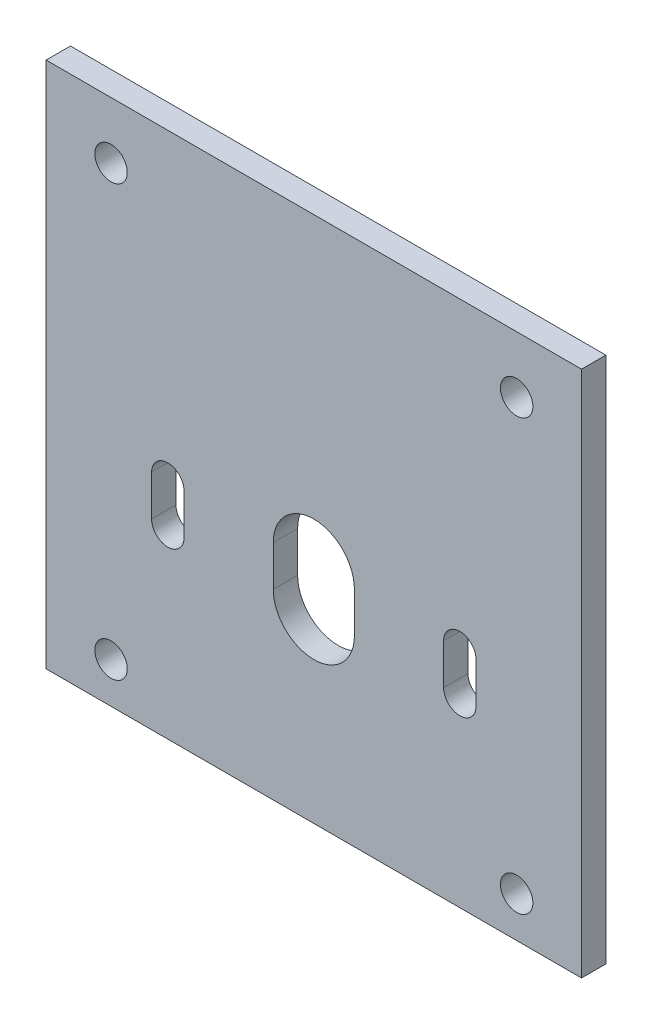
ISO-10303-21;
HEADER;
FILE_DESCRIPTION(('STEP AP214'),'2;1');
FILE_NAME('part.step','',(''),(''),'','','');
FILE_SCHEMA(('AUTOMOTIVE_DESIGN { 1 0 10303 214 1 1 1 1 }'));
ENDSEC;
DATA;
#1=APPLICATION_CONTEXT('core data for automotive mechanical design processes');
#2=APPLICATION_PROTOCOL_DEFINITION('international standard','automotive_design',2000,#1);
#3=PRODUCT_CONTEXT('',#1,'mechanical');
#4=PRODUCT('Part','Part','',(#3));
#5=PRODUCT_RELATED_PRODUCT_CATEGORY('part','',(#4));
#6=PRODUCT_DEFINITION_FORMATION('','',#4);
#7=PRODUCT_DEFINITION_CONTEXT('part definition',#1,'design');
#8=PRODUCT_DEFINITION('design','',#6,#7);
#9=PRODUCT_DEFINITION_SHAPE('','',#8);
#10=(LENGTH_UNIT() NAMED_UNIT(*) SI_UNIT(.MILLI.,.METRE.));
#11=(NAMED_UNIT(*) PLANE_ANGLE_UNIT() SI_UNIT($,.RADIAN.));
#12=(NAMED_UNIT(*) SI_UNIT($,.STERADIAN.) SOLID_ANGLE_UNIT());
#13=UNCERTAINTY_MEASURE_WITH_UNIT(LENGTH_MEASURE(1.E-05),#10,'distance_accuracy_value','');
#14=(GEOMETRIC_REPRESENTATION_CONTEXT(3) GLOBAL_UNCERTAINTY_ASSIGNED_CONTEXT((#13)) GLOBAL_UNIT_ASSIGNED_CONTEXT((#10,
#11,#12)) REPRESENTATION_CONTEXT('',''));
#15=CARTESIAN_POINT('',(0.,0.,0.));
#16=DIRECTION('',(0.,0.,1.));
#17=DIRECTION('',(1.,0.,0.));
#18=AXIS2_PLACEMENT_3D('',#15,#16,#17);
#19=CARTESIAN_POINT('',(-66.,0.,2.99999999999999));
#20=DIRECTION('',(0.,1.,0.));
#21=DIRECTION('',(0.,0.,1.));
#22=AXIS2_PLACEMENT_3D('',#19,#20,#21);
#23=PLANE('',#22);
#24=DIRECTION('',(0.,0.,1.));
#25=VECTOR('',#24,1.);
#26=CARTESIAN_POINT('',(0.,0.,2.99999999999999));
#27=LINE('',#26,#25);
#28=CARTESIAN_POINT('',(0.,0.,0.));
#29=VERTEX_POINT('',#28);
#30=CARTESIAN_POINT('',(0.,0.,2.99999999999999));
#31=VERTEX_POINT('',#30);
#32=EDGE_CURVE('E269',#29,#31,#27,.T.);
#33=ORIENTED_EDGE('',*,*,#32,.F.);
#34=DIRECTION('',(1.,0.,0.));
#35=VECTOR('',#34,1.);
#36=CARTESIAN_POINT('',(-66.,0.,0.));
#37=LINE('',#36,#35);
#38=CARTESIAN_POINT('',(-66.,0.,0.));
#39=VERTEX_POINT('',#38);
#40=EDGE_CURVE('E11',#39,#29,#37,.T.);
#41=ORIENTED_EDGE('',*,*,#40,.F.);
#42=DIRECTION('',(0.,0.,1.));
#43=VECTOR('',#42,1.);
#44=CARTESIAN_POINT('',(-66.,0.,2.99999999999999));
#45=LINE('',#44,#43);
#46=CARTESIAN_POINT('',(-66.,0.,2.99999999999999));
#47=VERTEX_POINT('',#46);
#48=EDGE_CURVE('E272',#39,#47,#45,.T.);
#49=ORIENTED_EDGE('',*,*,#48,.T.);
#50=DIRECTION('',(1.,0.,0.));
#51=VECTOR('',#50,1.);
#52=CARTESIAN_POINT('',(-66.,0.,2.99999999999999));
#53=LINE('',#52,#51);
#54=EDGE_CURVE('E36',#47,#31,#53,.T.);
#55=ORIENTED_EDGE('',*,*,#54,.T.);
#56=EDGE_LOOP('',(#33,#41,#49,#55));
#57=FACE_BOUND('',#56,.T.);
#58=ADVANCED_FACE('F33',(#57),#23,.T.);
#59=CARTESIAN_POINT('',(-66.,0.,0.));
#60=DIRECTION('',(0.,0.,-1.));
#61=DIRECTION('',(-1.,0.,0.));
#62=AXIS2_PLACEMENT_3D('',#59,#60,#61);
#63=PLANE('',#62);
#64=CARTESIAN_POINT('',(-58.,-60.,0.));
#65=DIRECTION('',(0.,0.,-1.));
#66=DIRECTION('',(-1.,0.,0.));
#67=AXIS2_PLACEMENT_3D('',#64,#65,#66);
#68=CIRCLE('',#67,2.);
#69=CARTESIAN_POINT('',(-60.,-60.,0.));
#70=VERTEX_POINT('',#69);
#71=EDGE_CURVE('E260',#70,#70,#68,.T.);
#72=ORIENTED_EDGE('',*,*,#71,.F.);
#73=EDGE_LOOP('',(#72));
#74=FACE_BOUND('',#73,.T.);
#75=CARTESIAN_POINT('',(-8.,-60.,0.));
#76=DIRECTION('',(0.,0.,-1.));
#77=DIRECTION('',(-1.,0.,0.));
#78=AXIS2_PLACEMENT_3D('',#75,#76,#77);
#79=CIRCLE('',#78,2.);
#80=CARTESIAN_POINT('',(-10.,-60.,0.));
#81=VERTEX_POINT('',#80);
#82=EDGE_CURVE('E190',#81,#81,#79,.T.);
#83=ORIENTED_EDGE('',*,*,#82,.F.);
#84=EDGE_LOOP('',(#83));
#85=FACE_BOUND('',#84,.T.);
#86=CARTESIAN_POINT('',(-58.,-7.,0.));
#87=DIRECTION('',(0.,0.,-1.));
#88=DIRECTION('',(-1.,0.,0.));
#89=AXIS2_PLACEMENT_3D('',#86,#87,#88);
#90=CIRCLE('',#89,2.);
#91=CARTESIAN_POINT('',(-60.,-7.,0.));
#92=VERTEX_POINT('',#91);
#93=EDGE_CURVE('E219',#92,#92,#90,.T.);
#94=ORIENTED_EDGE('',*,*,#93,.F.);
#95=EDGE_LOOP('',(#94));
#96=FACE_BOUND('',#95,.T.);
#97=CARTESIAN_POINT('',(-15.,-37.5,0.));
#98=DIRECTION('',(0.,0.,-1.));
#99=DIRECTION('',(-1.,0.,0.));
#100=AXIS2_PLACEMENT_3D('',#97,#98,#99);
#101=CIRCLE('',#100,2.00000000000001);
#102=CARTESIAN_POINT('',(-17.,-37.5,0.));
#103=VERTEX_POINT('',#102);
#104=CARTESIAN_POINT('',(-13.,-37.5,0.));
#105=VERTEX_POINT('',#104);
#106=EDGE_CURVE('E49',#103,#105,#101,.T.);
#107=ORIENTED_EDGE('',*,*,#106,.F.);
#108=DIRECTION('',(0.,1.,0.));
#109=VECTOR('',#108,1.);
#110=CARTESIAN_POINT('',(-17.,-37.5,0.));
#111=LINE('',#110,#109);
#112=CARTESIAN_POINT('',(-17.,-42.5,0.));
#113=VERTEX_POINT('',#112);
#114=EDGE_CURVE('E242',#113,#103,#111,.T.);
#115=ORIENTED_EDGE('',*,*,#114,.F.);
#116=CARTESIAN_POINT('',(-15.,-42.5,0.));
#117=DIRECTION('',(0.,0.,-1.));
#118=DIRECTION('',(-1.,0.,0.));
#119=AXIS2_PLACEMENT_3D('',#116,#117,#118);
#120=CIRCLE('',#119,2.00000000000001);
#121=CARTESIAN_POINT('',(-13.,-42.5,0.));
#122=VERTEX_POINT('',#121);
#123=EDGE_CURVE('E239',#122,#113,#120,.T.);
#124=ORIENTED_EDGE('',*,*,#123,.F.);
#125=DIRECTION('',(0.,-1.,0.));
#126=VECTOR('',#125,1.);
#127=CARTESIAN_POINT('',(-13.,-37.5,0.));
#128=LINE('',#127,#126);
#129=EDGE_CURVE('E236',#105,#122,#128,.T.);
#130=ORIENTED_EDGE('',*,*,#129,.F.);
#131=EDGE_LOOP('',(#107,#115,#124,#130));
#132=FACE_BOUND('',#131,.T.);
#133=CARTESIAN_POINT('',(-33.,-37.5,0.));
#134=DIRECTION('',(0.,0.,-1.));
#135=DIRECTION('',(-1.,0.,0.));
#136=AXIS2_PLACEMENT_3D('',#133,#134,#135);
#137=CIRCLE('',#136,5.);
#138=CARTESIAN_POINT('',(-38.,-37.5,0.));
#139=VERTEX_POINT('',#138);
#140=CARTESIAN_POINT('',(-28.,-37.5,0.));
#141=VERTEX_POINT('',#140);
#142=EDGE_CURVE('E57',#139,#141,#137,.T.);
#143=ORIENTED_EDGE('',*,*,#142,.F.);
#144=DIRECTION('',(0.,1.,0.));
#145=VECTOR('',#144,1.);
#146=CARTESIAN_POINT('',(-38.,-37.5,0.));
#147=LINE('',#146,#145);
#148=CARTESIAN_POINT('',(-38.,-42.5,0.));
#149=VERTEX_POINT('',#148);
#150=EDGE_CURVE('E163',#149,#139,#147,.T.);
#151=ORIENTED_EDGE('',*,*,#150,.F.);
#152=CARTESIAN_POINT('',(-33.,-42.5,0.));
#153=DIRECTION('',(0.,0.,-1.));
#154=DIRECTION('',(-1.,0.,0.));
#155=AXIS2_PLACEMENT_3D('',#152,#153,#154);
#156=CIRCLE('',#155,5.);
#157=CARTESIAN_POINT('',(-28.,-42.5,0.));
#158=VERTEX_POINT('',#157);
#159=EDGE_CURVE('E177',#158,#149,#156,.T.);
#160=ORIENTED_EDGE('',*,*,#159,.F.);
#161=DIRECTION('',(0.,-1.,0.));
#162=VECTOR('',#161,1.);
#163=CARTESIAN_POINT('',(-28.,-37.5,0.));
#164=LINE('',#163,#162);
#165=EDGE_CURVE('E170',#141,#158,#164,.T.);
#166=ORIENTED_EDGE('',*,*,#165,.F.);
#167=EDGE_LOOP('',(#143,#151,#160,#166));
#168=FACE_BOUND('',#167,.T.);
#169=CARTESIAN_POINT('',(-51.,-37.5,0.));
#170=DIRECTION('',(0.,0.,-1.));
#171=DIRECTION('',(-1.,0.,0.));
#172=AXIS2_PLACEMENT_3D('',#169,#170,#171);
#173=CIRCLE('',#172,1.99999999999999);
#174=CARTESIAN_POINT('',(-53.,-37.5,0.));
#175=VERTEX_POINT('',#174);
#176=CARTESIAN_POINT('',(-49.,-37.5,0.));
#177=VERTEX_POINT('',#176);
#178=EDGE_CURVE('E196',#175,#177,#173,.T.);
#179=ORIENTED_EDGE('',*,*,#178,.F.);
#180=DIRECTION('',(0.,1.,0.));
#181=VECTOR('',#180,1.);
#182=CARTESIAN_POINT('',(-53.,-37.5,0.));
#183=LINE('',#182,#181);
#184=CARTESIAN_POINT('',(-53.,-42.5,0.));
#185=VERTEX_POINT('',#184);
#186=EDGE_CURVE('E204',#185,#175,#183,.T.);
#187=ORIENTED_EDGE('',*,*,#186,.F.);
#188=CARTESIAN_POINT('',(-51.,-42.5,0.));
#189=DIRECTION('',(0.,0.,-1.));
#190=DIRECTION('',(-1.,0.,0.));
#191=AXIS2_PLACEMENT_3D('',#188,#189,#190);
#192=CIRCLE('',#191,2.);
#193=CARTESIAN_POINT('',(-49.,-42.5,0.));
#194=VERTEX_POINT('',#193);
#195=EDGE_CURVE('E201',#194,#185,#192,.T.);
#196=ORIENTED_EDGE('',*,*,#195,.F.);
#197=DIRECTION('',(0.,-1.,0.));
#198=VECTOR('',#197,1.);
#199=CARTESIAN_POINT('',(-49.,-37.5,0.));
#200=LINE('',#199,#198);
#201=EDGE_CURVE('E198',#177,#194,#200,.T.);
#202=ORIENTED_EDGE('',*,*,#201,.F.);
#203=EDGE_LOOP('',(#179,#187,#196,#202));
#204=FACE_BOUND('',#203,.T.);
#205=CARTESIAN_POINT('',(-8.,-7.00000000000001,0.));
#206=DIRECTION('',(0.,0.,-1.));
#207=DIRECTION('',(-1.,0.,0.));
#208=AXIS2_PLACEMENT_3D('',#205,#206,#207);
#209=CIRCLE('',#208,2.);
#210=CARTESIAN_POINT('',(-10.,-7.00000000000001,0.));
#211=VERTEX_POINT('',#210);
#212=EDGE_CURVE('E266',#211,#211,#209,.T.);
#213=ORIENTED_EDGE('',*,*,#212,.F.);
#214=EDGE_LOOP('',(#213));
#215=FACE_BOUND('',#214,.T.);
#216=DIRECTION('',(0.,1.,0.));
#217=VECTOR('',#216,1.);
#218=CARTESIAN_POINT('',(0.,0.,0.));
#219=LINE('',#218,#217);
#220=CARTESIAN_POINT('',(0.,-65.,0.));
#221=VERTEX_POINT('',#220);
#222=EDGE_CURVE('E276',#221,#29,#219,.T.);
#223=ORIENTED_EDGE('',*,*,#222,.F.);
#224=DIRECTION('',(1.,0.,0.));
#225=VECTOR('',#224,1.);
#226=CARTESIAN_POINT('',(-66.,-65.,0.));
#227=LINE('',#226,#225);
#228=CARTESIAN_POINT('',(-66.,-65.,0.));
#229=VERTEX_POINT('',#228);
#230=EDGE_CURVE('E41',#229,#221,#227,.T.);
#231=ORIENTED_EDGE('',*,*,#230,.F.);
#232=DIRECTION('',(0.,1.,0.));
#233=VECTOR('',#232,1.);
#234=CARTESIAN_POINT('',(-66.,0.,0.));
#235=LINE('',#234,#233);
#236=EDGE_CURVE('E282',#229,#39,#235,.T.);
#237=ORIENTED_EDGE('',*,*,#236,.T.);
#238=ORIENTED_EDGE('',*,*,#40,.T.);
#239=EDGE_LOOP('',(#223,#231,#237,#238));
#240=FACE_BOUND('',#239,.T.);
#241=ADVANCED_FACE('F307',(#74,#85,#96,#132,#168,#204,#215,#240),#63,.T.);
#242=CARTESIAN_POINT('',(-66.,-65.,0.));
#243=DIRECTION('',(0.,-1.,0.));
#244=DIRECTION('',(0.,0.,-1.));
#245=AXIS2_PLACEMENT_3D('',#242,#243,#244);
#246=PLANE('',#245);
#247=DIRECTION('',(0.,0.,-1.));
#248=VECTOR('',#247,1.);
#249=CARTESIAN_POINT('',(0.,-65.,0.));
#250=LINE('',#249,#248);
#251=CARTESIAN_POINT('',(0.,-65.,2.99999999999999));
#252=VERTEX_POINT('',#251);
#253=EDGE_CURVE('E290',#252,#221,#250,.T.);
#254=ORIENTED_EDGE('',*,*,#253,.F.);
#255=DIRECTION('',(1.,0.,0.));
#256=VECTOR('',#255,1.);
#257=CARTESIAN_POINT('',(-66.,-65.,2.99999999999999));
#258=LINE('',#257,#256);
#259=CARTESIAN_POINT('',(-66.,-65.,2.99999999999999));
#260=VERTEX_POINT('',#259);
#261=EDGE_CURVE('E295',#260,#252,#258,.T.);
#262=ORIENTED_EDGE('',*,*,#261,.F.);
#263=DIRECTION('',(0.,0.,-1.));
#264=VECTOR('',#263,1.);
#265=CARTESIAN_POINT('',(-66.,-65.,0.));
#266=LINE('',#265,#264);
#267=EDGE_CURVE('E279',#260,#229,#266,.T.);
#268=ORIENTED_EDGE('',*,*,#267,.T.);
#269=ORIENTED_EDGE('',*,*,#230,.T.);
#270=EDGE_LOOP('',(#254,#262,#268,#269));
#271=FACE_BOUND('',#270,.T.);
#272=ADVANCED_FACE('F313',(#271),#246,.T.);
#273=CARTESIAN_POINT('',(-66.,-65.,2.99999999999999));
#274=DIRECTION('',(0.,0.,1.));
#275=DIRECTION('',(1.,0.,0.));
#276=AXIS2_PLACEMENT_3D('',#273,#274,#275);
#277=PLANE('',#276);
#278=CARTESIAN_POINT('',(-58.,-60.,2.99999999999999));
#279=DIRECTION('',(0.,0.,1.));
#280=DIRECTION('',(1.,0.,0.));
#281=AXIS2_PLACEMENT_3D('',#278,#279,#280);
#282=CIRCLE('',#281,2.);
#283=CARTESIAN_POINT('',(-56.,-60.,2.99999999999999));
#284=VERTEX_POINT('',#283);
#285=EDGE_CURVE('E263',#284,#284,#282,.F.);
#286=ORIENTED_EDGE('',*,*,#285,.T.);
#287=EDGE_LOOP('',(#286));
#288=FACE_BOUND('',#287,.T.);
#289=CARTESIAN_POINT('',(-8.,-60.,2.99999999999999));
#290=DIRECTION('',(0.,0.,1.));
#291=DIRECTION('',(1.,0.,0.));
#292=AXIS2_PLACEMENT_3D('',#289,#290,#291);
#293=CIRCLE('',#292,2.);
#294=CARTESIAN_POINT('',(-6.,-60.,2.99999999999999));
#295=VERTEX_POINT('',#294);
#296=EDGE_CURVE('E257',#295,#295,#293,.F.);
#297=ORIENTED_EDGE('',*,*,#296,.T.);
#298=EDGE_LOOP('',(#297));
#299=FACE_BOUND('',#298,.T.);
#300=CARTESIAN_POINT('',(-58.,-7.,2.99999999999999));
#301=DIRECTION('',(0.,0.,1.));
#302=DIRECTION('',(1.,0.,0.));
#303=AXIS2_PLACEMENT_3D('',#300,#301,#302);
#304=CIRCLE('',#303,2.);
#305=CARTESIAN_POINT('',(-56.,-7.,2.99999999999999));
#306=VERTEX_POINT('',#305);
#307=EDGE_CURVE('E223',#306,#306,#304,.F.);
#308=ORIENTED_EDGE('',*,*,#307,.T.);
#309=EDGE_LOOP('',(#308));
#310=FACE_BOUND('',#309,.T.);
#311=CARTESIAN_POINT('',(-15.,-37.5,2.99999999999999));
#312=DIRECTION('',(0.,0.,1.));
#313=DIRECTION('',(1.,0.,0.));
#314=AXIS2_PLACEMENT_3D('',#311,#312,#313);
#315=CIRCLE('',#314,2.00000000000001);
#316=CARTESIAN_POINT('',(-17.,-37.5,2.99999999999999));
#317=VERTEX_POINT('',#316);
#318=CARTESIAN_POINT('',(-13.,-37.5,2.99999999999999));
#319=VERTEX_POINT('',#318);
#320=EDGE_CURVE('E232',#317,#319,#315,.F.);
#321=ORIENTED_EDGE('',*,*,#320,.T.);
#322=DIRECTION('',(0.,-1.,0.));
#323=VECTOR('',#322,1.);
#324=CARTESIAN_POINT('',(-13.,-37.5,2.99999999999999));
#325=LINE('',#324,#323);
#326=CARTESIAN_POINT('',(-13.,-42.5,2.99999999999999));
#327=VERTEX_POINT('',#326);
#328=EDGE_CURVE('E226',#319,#327,#325,.T.);
#329=ORIENTED_EDGE('',*,*,#328,.T.);
#330=CARTESIAN_POINT('',(-15.,-42.5,2.99999999999999));
#331=DIRECTION('',(0.,0.,1.));
#332=DIRECTION('',(1.,0.,0.));
#333=AXIS2_PLACEMENT_3D('',#330,#331,#332);
#334=CIRCLE('',#333,2.00000000000001);
#335=CARTESIAN_POINT('',(-17.,-42.5,2.99999999999999));
#336=VERTEX_POINT('',#335);
#337=EDGE_CURVE('E157',#327,#336,#334,.F.);
#338=ORIENTED_EDGE('',*,*,#337,.T.);
#339=DIRECTION('',(0.,1.,0.));
#340=VECTOR('',#339,1.);
#341=CARTESIAN_POINT('',(-17.,-37.5,2.99999999999999));
#342=LINE('',#341,#340);
#343=EDGE_CURVE('E229',#336,#317,#342,.T.);
#344=ORIENTED_EDGE('',*,*,#343,.T.);
#345=EDGE_LOOP('',(#321,#329,#338,#344));
#346=FACE_BOUND('',#345,.T.);
#347=CARTESIAN_POINT('',(-33.,-37.5,2.99999999999999));
#348=DIRECTION('',(0.,0.,1.));
#349=DIRECTION('',(1.,0.,0.));
#350=AXIS2_PLACEMENT_3D('',#347,#348,#349);
#351=CIRCLE('',#350,5.);
#352=CARTESIAN_POINT('',(-38.,-37.5,2.99999999999999));
#353=VERTEX_POINT('',#352);
#354=CARTESIAN_POINT('',(-28.,-37.5,2.99999999999999));
#355=VERTEX_POINT('',#354);
#356=EDGE_CURVE('E161',#353,#355,#351,.F.);
#357=ORIENTED_EDGE('',*,*,#356,.T.);
#358=DIRECTION('',(0.,-1.,0.));
#359=VECTOR('',#358,1.);
#360=CARTESIAN_POINT('',(-28.,-37.5,2.99999999999999));
#361=LINE('',#360,#359);
#362=CARTESIAN_POINT('',(-28.,-42.5,2.99999999999999));
#363=VERTEX_POINT('',#362);
#364=EDGE_CURVE('E147',#355,#363,#361,.T.);
#365=ORIENTED_EDGE('',*,*,#364,.T.);
#366=CARTESIAN_POINT('',(-33.,-42.5,2.99999999999999));
#367=DIRECTION('',(0.,0.,1.));
#368=DIRECTION('',(1.,0.,0.));
#369=AXIS2_PLACEMENT_3D('',#366,#367,#368);
#370=CIRCLE('',#369,5.);
#371=CARTESIAN_POINT('',(-38.,-42.5,2.99999999999999));
#372=VERTEX_POINT('',#371);
#373=EDGE_CURVE('E172',#363,#372,#370,.F.);
#374=ORIENTED_EDGE('',*,*,#373,.T.);
#375=DIRECTION('',(0.,1.,0.));
#376=VECTOR('',#375,1.);
#377=CARTESIAN_POINT('',(-38.,-37.5,2.99999999999999));
#378=LINE('',#377,#376);
#379=EDGE_CURVE('E168',#372,#353,#378,.T.);
#380=ORIENTED_EDGE('',*,*,#379,.T.);
#381=EDGE_LOOP('',(#357,#365,#374,#380));
#382=FACE_BOUND('',#381,.T.);
#383=CARTESIAN_POINT('',(-51.,-37.5,2.99999999999999));
#384=DIRECTION('',(0.,0.,1.));
#385=DIRECTION('',(1.,0.,0.));
#386=AXIS2_PLACEMENT_3D('',#383,#384,#385);
#387=CIRCLE('',#386,1.99999999999999);
#388=CARTESIAN_POINT('',(-53.,-37.5,2.99999999999999));
#389=VERTEX_POINT('',#388);
#390=CARTESIAN_POINT('',(-49.,-37.5,2.99999999999999));
#391=VERTEX_POINT('',#390);
#392=EDGE_CURVE('E193',#389,#391,#387,.F.);
#393=ORIENTED_EDGE('',*,*,#392,.T.);
#394=DIRECTION('',(0.,-1.,0.));
#395=VECTOR('',#394,1.);
#396=CARTESIAN_POINT('',(-49.,-37.5,2.99999999999999));
#397=LINE('',#396,#395);
#398=CARTESIAN_POINT('',(-49.,-42.5,2.99999999999999));
#399=VERTEX_POINT('',#398);
#400=EDGE_CURVE('E210',#391,#399,#397,.T.);
#401=ORIENTED_EDGE('',*,*,#400,.T.);
#402=CARTESIAN_POINT('',(-51.,-42.5,2.99999999999999));
#403=DIRECTION('',(0.,0.,1.));
#404=DIRECTION('',(1.,0.,0.));
#405=AXIS2_PLACEMENT_3D('',#402,#403,#404);
#406=CIRCLE('',#405,2.);
#407=CARTESIAN_POINT('',(-53.,-42.5,2.99999999999999));
#408=VERTEX_POINT('',#407);
#409=EDGE_CURVE('E186',#399,#408,#406,.F.);
#410=ORIENTED_EDGE('',*,*,#409,.T.);
#411=DIRECTION('',(0.,1.,0.));
#412=VECTOR('',#411,1.);
#413=CARTESIAN_POINT('',(-53.,-37.5,2.99999999999999));
#414=LINE('',#413,#412);
#415=EDGE_CURVE('E189',#408,#389,#414,.T.);
#416=ORIENTED_EDGE('',*,*,#415,.T.);
#417=EDGE_LOOP('',(#393,#401,#410,#416));
#418=FACE_BOUND('',#417,.T.);
#419=CARTESIAN_POINT('',(-8.,-7.00000000000001,2.99999999999999));
#420=DIRECTION('',(0.,0.,1.));
#421=DIRECTION('',(1.,0.,0.));
#422=AXIS2_PLACEMENT_3D('',#419,#420,#421);
#423=CIRCLE('',#422,2.);
#424=CARTESIAN_POINT('',(-6.,-7.00000000000001,2.99999999999999));
#425=VERTEX_POINT('',#424);
#426=EDGE_CURVE('E222',#425,#425,#423,.F.);
#427=ORIENTED_EDGE('',*,*,#426,.T.);
#428=EDGE_LOOP('',(#427));
#429=FACE_BOUND('',#428,.T.);
#430=DIRECTION('',(0.,-1.,0.));
#431=VECTOR('',#430,1.);
#432=CARTESIAN_POINT('',(0.,-65.,2.99999999999999));
#433=LINE('',#432,#431);
#434=EDGE_CURVE('E287',#31,#252,#433,.T.);
#435=ORIENTED_EDGE('',*,*,#434,.F.);
#436=ORIENTED_EDGE('',*,*,#54,.F.);
#437=DIRECTION('',(0.,-1.,0.));
#438=VECTOR('',#437,1.);
#439=CARTESIAN_POINT('',(-66.,-65.,2.99999999999999));
#440=LINE('',#439,#438);
#441=EDGE_CURVE('E275',#47,#260,#440,.T.);
#442=ORIENTED_EDGE('',*,*,#441,.T.);
#443=ORIENTED_EDGE('',*,*,#261,.T.);
#444=EDGE_LOOP('',(#435,#436,#442,#443));
#445=FACE_BOUND('',#444,.T.);
#446=ADVANCED_FACE('F166',(#288,#299,#310,#346,#382,#418,#429,#445),#277,.T.);
#447=CARTESIAN_POINT('',(-66.,0.,0.));
#448=DIRECTION('',(-1.,0.,0.));
#449=DIRECTION('',(0.,0.,1.));
#450=AXIS2_PLACEMENT_3D('',#447,#448,#449);
#451=PLANE('',#450);
#452=ORIENTED_EDGE('',*,*,#48,.F.);
#453=ORIENTED_EDGE('',*,*,#236,.F.);
#454=ORIENTED_EDGE('',*,*,#267,.F.);
#455=ORIENTED_EDGE('',*,*,#441,.F.);
#456=EDGE_LOOP('',(#452,#453,#454,#455));
#457=FACE_BOUND('',#456,.T.);
#458=ADVANCED_FACE('F310',(#457),#451,.T.);
#459=CARTESIAN_POINT('',(0.,0.,0.));
#460=DIRECTION('',(-1.,0.,0.));
#461=DIRECTION('',(0.,0.,1.));
#462=AXIS2_PLACEMENT_3D('',#459,#460,#461);
#463=PLANE('',#462);
#464=ORIENTED_EDGE('',*,*,#32,.T.);
#465=ORIENTED_EDGE('',*,*,#434,.T.);
#466=ORIENTED_EDGE('',*,*,#253,.T.);
#467=ORIENTED_EDGE('',*,*,#222,.T.);
#468=EDGE_LOOP('',(#464,#465,#466,#467));
#469=FACE_BOUND('',#468,.T.);
#470=ADVANCED_FACE('F304',(#469),#463,.F.);
#471=CARTESIAN_POINT('',(-8.,-7.00000000000001,3.00099999999999));
#472=DIRECTION('',(0.,0.,-1.));
#473=DIRECTION('',(-1.,0.,0.));
#474=AXIS2_PLACEMENT_3D('',#471,#472,#473);
#475=CYLINDRICAL_SURFACE('',#474,2.);
#476=ORIENTED_EDGE('',*,*,#426,.F.);
#477=EDGE_LOOP('',(#476));
#478=FACE_BOUND('',#477,.T.);
#479=ORIENTED_EDGE('',*,*,#212,.T.);
#480=EDGE_LOOP('',(#479));
#481=FACE_BOUND('',#480,.T.);
#482=ADVANCED_FACE('F349',(#478,#481),#475,.F.);
#483=CARTESIAN_POINT('',(-51.,-37.5,3.00099999999999));
#484=DIRECTION('',(0.,0.,-1.));
#485=DIRECTION('',(-1.,0.,0.));
#486=AXIS2_PLACEMENT_3D('',#483,#484,#485);
#487=CYLINDRICAL_SURFACE('',#486,1.99999999999999);
#488=DIRECTION('',(0.,0.,-1.));
#489=VECTOR('',#488,1.);
#490=CARTESIAN_POINT('',(-53.,-37.5,3.00099999999999));
#491=LINE('',#490,#489);
#492=EDGE_CURVE('E208',#389,#175,#491,.T.);
#493=ORIENTED_EDGE('',*,*,#492,.T.);
#494=ORIENTED_EDGE('',*,*,#178,.T.);
#495=DIRECTION('',(0.,0.,-1.));
#496=VECTOR('',#495,1.);
#497=CARTESIAN_POINT('',(-49.,-37.5,3.00099999999999));
#498=LINE('',#497,#496);
#499=EDGE_CURVE('E207',#391,#177,#498,.T.);
#500=ORIENTED_EDGE('',*,*,#499,.F.);
#501=ORIENTED_EDGE('',*,*,#392,.F.);
#502=EDGE_LOOP('',(#493,#494,#500,#501));
#503=FACE_BOUND('',#502,.T.);
#504=ADVANCED_FACE('F354',(#503),#487,.F.);
#505=CARTESIAN_POINT('',(-53.,-37.5,3.00099999999999));
#506=DIRECTION('',(-1.,0.,0.));
#507=DIRECTION('',(0.,-1.,0.));
#508=AXIS2_PLACEMENT_3D('',#505,#506,#507);
#509=PLANE('',#508);
#510=DIRECTION('',(0.,0.,-1.));
#511=VECTOR('',#510,1.);
#512=CARTESIAN_POINT('',(-53.,-42.5,3.00099999999999));
#513=LINE('',#512,#511);
#514=EDGE_CURVE('E211',#408,#185,#513,.T.);
#515=ORIENTED_EDGE('',*,*,#514,.T.);
#516=ORIENTED_EDGE('',*,*,#186,.T.);
#517=ORIENTED_EDGE('',*,*,#492,.F.);
#518=ORIENTED_EDGE('',*,*,#415,.F.);
#519=EDGE_LOOP('',(#515,#516,#517,#518));
#520=FACE_BOUND('',#519,.T.);
#521=ADVANCED_FACE('F364',(#520),#509,.F.);
#522=CARTESIAN_POINT('',(-51.,-42.5,3.00099999999999));
#523=DIRECTION('',(0.,0.,-1.));
#524=DIRECTION('',(-1.,0.,0.));
#525=AXIS2_PLACEMENT_3D('',#522,#523,#524);
#526=CYLINDRICAL_SURFACE('',#525,2.);
#527=DIRECTION('',(0.,0.,-1.));
#528=VECTOR('',#527,1.);
#529=CARTESIAN_POINT('',(-49.,-42.5,3.00099999999999));
#530=LINE('',#529,#528);
#531=EDGE_CURVE('E213',#399,#194,#530,.T.);
#532=ORIENTED_EDGE('',*,*,#531,.T.);
#533=ORIENTED_EDGE('',*,*,#195,.T.);
#534=ORIENTED_EDGE('',*,*,#514,.F.);
#535=ORIENTED_EDGE('',*,*,#409,.F.);
#536=EDGE_LOOP('',(#532,#533,#534,#535));
#537=FACE_BOUND('',#536,.T.);
#538=ADVANCED_FACE('F374',(#537),#526,.F.);
#539=CARTESIAN_POINT('',(-49.,-37.5,3.00099999999999));
#540=DIRECTION('',(1.,0.,0.));
#541=DIRECTION('',(0.,1.,0.));
#542=AXIS2_PLACEMENT_3D('',#539,#540,#541);
#543=PLANE('',#542);
#544=ORIENTED_EDGE('',*,*,#499,.T.);
#545=ORIENTED_EDGE('',*,*,#201,.T.);
#546=ORIENTED_EDGE('',*,*,#531,.F.);
#547=ORIENTED_EDGE('',*,*,#400,.F.);
#548=EDGE_LOOP('',(#544,#545,#546,#547));
#549=FACE_BOUND('',#548,.T.);
#550=ADVANCED_FACE('F384',(#549),#543,.F.);
#551=CARTESIAN_POINT('',(-33.,-37.5,3.00099999999999));
#552=DIRECTION('',(0.,0.,-1.));
#553=DIRECTION('',(-1.,0.,0.));
#554=AXIS2_PLACEMENT_3D('',#551,#552,#553);
#555=CYLINDRICAL_SURFACE('',#554,5.);
#556=DIRECTION('',(0.,0.,-1.));
#557=VECTOR('',#556,1.);
#558=CARTESIAN_POINT('',(-38.,-37.5,3.00099999999999));
#559=LINE('',#558,#557);
#560=EDGE_CURVE('E158',#353,#139,#559,.T.);
#561=ORIENTED_EDGE('',*,*,#560,.T.);
#562=ORIENTED_EDGE('',*,*,#142,.T.);
#563=DIRECTION('',(0.,0.,-1.));
#564=VECTOR('',#563,1.);
#565=CARTESIAN_POINT('',(-28.,-37.5,3.00099999999999));
#566=LINE('',#565,#564);
#567=EDGE_CURVE('E150',#355,#141,#566,.T.);
#568=ORIENTED_EDGE('',*,*,#567,.F.);
#569=ORIENTED_EDGE('',*,*,#356,.F.);
#570=EDGE_LOOP('',(#561,#562,#568,#569));
#571=FACE_BOUND('',#570,.T.);
#572=ADVANCED_FACE('F160',(#571),#555,.F.);
#573=CARTESIAN_POINT('',(-38.,-37.5,3.00099999999999));
#574=DIRECTION('',(-1.,0.,0.));
#575=DIRECTION('',(0.,-1.,0.));
#576=AXIS2_PLACEMENT_3D('',#573,#574,#575);
#577=PLANE('',#576);
#578=DIRECTION('',(0.,0.,-1.));
#579=VECTOR('',#578,1.);
#580=CARTESIAN_POINT('',(-38.,-42.5,3.00099999999999));
#581=LINE('',#580,#579);
#582=EDGE_CURVE('E183',#372,#149,#581,.T.);
#583=ORIENTED_EDGE('',*,*,#582,.T.);
#584=ORIENTED_EDGE('',*,*,#150,.T.);
#585=ORIENTED_EDGE('',*,*,#560,.F.);
#586=ORIENTED_EDGE('',*,*,#379,.F.);
#587=EDGE_LOOP('',(#583,#584,#585,#586));
#588=FACE_BOUND('',#587,.T.);
#589=ADVANCED_FACE('F403',(#588),#577,.F.);
#590=CARTESIAN_POINT('',(-33.,-42.5,3.00099999999999));
#591=DIRECTION('',(0.,0.,-1.));
#592=DIRECTION('',(-1.,0.,0.));
#593=AXIS2_PLACEMENT_3D('',#590,#591,#592);
#594=CYLINDRICAL_SURFACE('',#593,5.);
#595=DIRECTION('',(0.,0.,-1.));
#596=VECTOR('',#595,1.);
#597=CARTESIAN_POINT('',(-28.,-42.5,3.00099999999999));
#598=LINE('',#597,#596);
#599=EDGE_CURVE('E152',#363,#158,#598,.T.);
#600=ORIENTED_EDGE('',*,*,#599,.T.);
#601=ORIENTED_EDGE('',*,*,#159,.T.);
#602=ORIENTED_EDGE('',*,*,#582,.F.);
#603=ORIENTED_EDGE('',*,*,#373,.F.);
#604=EDGE_LOOP('',(#600,#601,#602,#603));
#605=FACE_BOUND('',#604,.T.);
#606=ADVANCED_FACE('F412',(#605),#594,.F.);
#607=CARTESIAN_POINT('',(-28.,-37.5,3.00099999999999));
#608=DIRECTION('',(1.,0.,0.));
#609=DIRECTION('',(0.,1.,0.));
#610=AXIS2_PLACEMENT_3D('',#607,#608,#609);
#611=PLANE('',#610);
#612=ORIENTED_EDGE('',*,*,#567,.T.);
#613=ORIENTED_EDGE('',*,*,#165,.T.);
#614=ORIENTED_EDGE('',*,*,#599,.F.);
#615=ORIENTED_EDGE('',*,*,#364,.F.);
#616=EDGE_LOOP('',(#612,#613,#614,#615));
#617=FACE_BOUND('',#616,.T.);
#618=ADVANCED_FACE('F148',(#617),#611,.F.);
#619=CARTESIAN_POINT('',(-15.,-37.5,3.00099999999999));
#620=DIRECTION('',(0.,0.,-1.));
#621=DIRECTION('',(-1.,0.,0.));
#622=AXIS2_PLACEMENT_3D('',#619,#620,#621);
#623=CYLINDRICAL_SURFACE('',#622,2.00000000000001);
#624=DIRECTION('',(0.,0.,-1.));
#625=VECTOR('',#624,1.);
#626=CARTESIAN_POINT('',(-17.,-37.5,3.00099999999999));
#627=LINE('',#626,#625);
#628=EDGE_CURVE('E246',#317,#103,#627,.T.);
#629=ORIENTED_EDGE('',*,*,#628,.T.);
#630=ORIENTED_EDGE('',*,*,#106,.T.);
#631=DIRECTION('',(0.,0.,-1.));
#632=VECTOR('',#631,1.);
#633=CARTESIAN_POINT('',(-13.,-37.5,3.00099999999999));
#634=LINE('',#633,#632);
#635=EDGE_CURVE('E245',#319,#105,#634,.T.);
#636=ORIENTED_EDGE('',*,*,#635,.F.);
#637=ORIENTED_EDGE('',*,*,#320,.F.);
#638=EDGE_LOOP('',(#629,#630,#636,#637));
#639=FACE_BOUND('',#638,.T.);
#640=ADVANCED_FACE('F431',(#639),#623,.F.);
#641=CARTESIAN_POINT('',(-17.,-37.5,3.00099999999999));
#642=DIRECTION('',(-1.,0.,0.));
#643=DIRECTION('',(0.,0.,1.));
#644=AXIS2_PLACEMENT_3D('',#641,#642,#643);
#645=PLANE('',#644);
#646=DIRECTION('',(0.,0.,-1.));
#647=VECTOR('',#646,1.);
#648=CARTESIAN_POINT('',(-17.,-42.5,3.00099999999999));
#649=LINE('',#648,#647);
#650=EDGE_CURVE('E248',#336,#113,#649,.T.);
#651=ORIENTED_EDGE('',*,*,#650,.T.);
#652=ORIENTED_EDGE('',*,*,#114,.T.);
#653=ORIENTED_EDGE('',*,*,#628,.F.);
#654=ORIENTED_EDGE('',*,*,#343,.F.);
#655=EDGE_LOOP('',(#651,#652,#653,#654));
#656=FACE_BOUND('',#655,.T.);
#657=ADVANCED_FACE('F440',(#656),#645,.F.);
#658=CARTESIAN_POINT('',(-15.,-42.5,3.00099999999999));
#659=DIRECTION('',(0.,0.,-1.));
#660=DIRECTION('',(-1.,0.,0.));
#661=AXIS2_PLACEMENT_3D('',#658,#659,#660);
#662=CYLINDRICAL_SURFACE('',#661,2.00000000000001);
#663=DIRECTION('',(0.,0.,-1.));
#664=VECTOR('',#663,1.);
#665=CARTESIAN_POINT('',(-13.,-42.5,3.00099999999999));
#666=LINE('',#665,#664);
#667=EDGE_CURVE('E250',#327,#122,#666,.T.);
#668=ORIENTED_EDGE('',*,*,#667,.T.);
#669=ORIENTED_EDGE('',*,*,#123,.T.);
#670=ORIENTED_EDGE('',*,*,#650,.F.);
#671=ORIENTED_EDGE('',*,*,#337,.F.);
#672=EDGE_LOOP('',(#668,#669,#670,#671));
#673=FACE_BOUND('',#672,.T.);
#674=ADVANCED_FACE('F449',(#673),#662,.F.);
#675=CARTESIAN_POINT('',(-13.,-37.5,3.00099999999999));
#676=DIRECTION('',(1.,0.,0.));
#677=DIRECTION('',(0.,0.,-1.));
#678=AXIS2_PLACEMENT_3D('',#675,#676,#677);
#679=PLANE('',#678);
#680=ORIENTED_EDGE('',*,*,#635,.T.);
#681=ORIENTED_EDGE('',*,*,#129,.T.);
#682=ORIENTED_EDGE('',*,*,#667,.F.);
#683=ORIENTED_EDGE('',*,*,#328,.F.);
#684=EDGE_LOOP('',(#680,#681,#682,#683));
#685=FACE_BOUND('',#684,.T.);
#686=ADVANCED_FACE('F459',(#685),#679,.F.);
#687=CARTESIAN_POINT('',(-58.,-7.,3.00099999999999));
#688=DIRECTION('',(0.,0.,-1.));
#689=DIRECTION('',(-1.,0.,0.));
#690=AXIS2_PLACEMENT_3D('',#687,#688,#689);
#691=CYLINDRICAL_SURFACE('',#690,2.);
#692=ORIENTED_EDGE('',*,*,#307,.F.);
#693=EDGE_LOOP('',(#692));
#694=FACE_BOUND('',#693,.T.);
#695=ORIENTED_EDGE('',*,*,#93,.T.);
#696=EDGE_LOOP('',(#695));
#697=FACE_BOUND('',#696,.T.);
#698=ADVANCED_FACE('F469',(#694,#697),#691,.F.);
#699=CARTESIAN_POINT('',(-8.,-60.,3.00099999999999));
#700=DIRECTION('',(0.,0.,-1.));
#701=DIRECTION('',(-1.,0.,0.));
#702=AXIS2_PLACEMENT_3D('',#699,#700,#701);
#703=CYLINDRICAL_SURFACE('',#702,2.);
#704=ORIENTED_EDGE('',*,*,#296,.F.);
#705=EDGE_LOOP('',(#704));
#706=FACE_BOUND('',#705,.T.);
#707=ORIENTED_EDGE('',*,*,#82,.T.);
#708=EDGE_LOOP('',(#707));
#709=FACE_BOUND('',#708,.T.);
#710=ADVANCED_FACE('F479',(#706,#709),#703,.F.);
#711=CARTESIAN_POINT('',(-58.,-60.,3.00099999999999));
#712=DIRECTION('',(0.,0.,-1.));
#713=DIRECTION('',(-1.,0.,0.));
#714=AXIS2_PLACEMENT_3D('',#711,#712,#713);
#715=CYLINDRICAL_SURFACE('',#714,2.);
#716=ORIENTED_EDGE('',*,*,#285,.F.);
#717=EDGE_LOOP('',(#716));
#718=FACE_BOUND('',#717,.T.);
#719=ORIENTED_EDGE('',*,*,#71,.T.);
#720=EDGE_LOOP('',(#719));
#721=FACE_BOUND('',#720,.T.);
#722=ADVANCED_FACE('F489',(#718,#721),#715,.F.);
#723=CLOSED_SHELL('',(#58,#241,#272,#446,#458,#470,#482,#504,#521,#538,#550,#572,#589,#606,#618,
#640,#657,#674,#686,#698,#710,#722));
#724=MANIFOLD_SOLID_BREP('B2',#723);
#725=ADVANCED_BREP_SHAPE_REPRESENTATION('',(#18,#724),#14);
#726=SHAPE_DEFINITION_REPRESENTATION(#9,#725);
ENDSEC;
END-ISO-10303-21;
